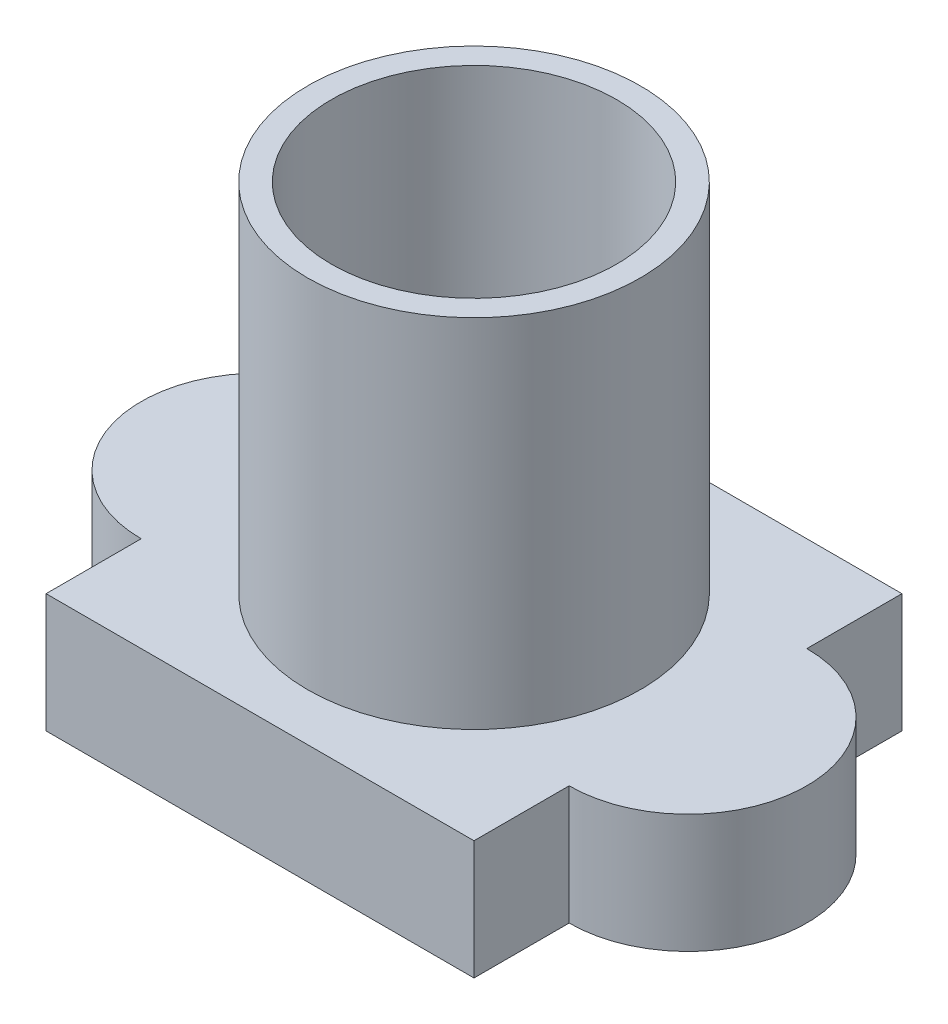
ISO-10303-21;
HEADER;
FILE_DESCRIPTION(('STEP AP214'),'2;1');
FILE_NAME('part.step','',(''),(''),'','','');
FILE_SCHEMA(('AUTOMOTIVE_DESIGN { 1 0 10303 214 1 1 1 1 }'));
ENDSEC;
DATA;
#1=APPLICATION_CONTEXT('core data for automotive mechanical design processes');
#2=APPLICATION_PROTOCOL_DEFINITION('international standard','automotive_design',2000,#1);
#3=PRODUCT_CONTEXT('',#1,'mechanical');
#4=PRODUCT('Part','Part','',(#3));
#5=PRODUCT_RELATED_PRODUCT_CATEGORY('part','',(#4));
#6=PRODUCT_DEFINITION_FORMATION('','',#4);
#7=PRODUCT_DEFINITION_CONTEXT('part definition',#1,'design');
#8=PRODUCT_DEFINITION('design','',#6,#7);
#9=PRODUCT_DEFINITION_SHAPE('','',#8);
#10=(LENGTH_UNIT() NAMED_UNIT(*) SI_UNIT(.MILLI.,.METRE.));
#11=(NAMED_UNIT(*) PLANE_ANGLE_UNIT() SI_UNIT($,.RADIAN.));
#12=(NAMED_UNIT(*) SI_UNIT($,.STERADIAN.) SOLID_ANGLE_UNIT());
#13=UNCERTAINTY_MEASURE_WITH_UNIT(LENGTH_MEASURE(1.E-05),#10,'distance_accuracy_value','');
#14=(GEOMETRIC_REPRESENTATION_CONTEXT(3) GLOBAL_UNCERTAINTY_ASSIGNED_CONTEXT((#13)) GLOBAL_UNIT_ASSIGNED_CONTEXT((#10,
#11,#12)) REPRESENTATION_CONTEXT('',''));
#15=CARTESIAN_POINT('',(0.,0.,0.));
#16=DIRECTION('',(0.,0.,1.));
#17=DIRECTION('',(1.,0.,0.));
#18=AXIS2_PLACEMENT_3D('',#15,#16,#17);
#19=CARTESIAN_POINT('',(0.,0.,0.));
#20=DIRECTION('',(0.,1.,0.));
#21=DIRECTION('',(0.,0.,1.));
#22=AXIS2_PLACEMENT_3D('',#19,#20,#21);
#23=CYLINDRICAL_SURFACE('',#22,6.);
#24=CARTESIAN_POINT('',(0.,20.,0.));
#25=DIRECTION('',(0.,1.,0.));
#26=DIRECTION('',(0.,0.,1.));
#27=AXIS2_PLACEMENT_3D('',#24,#25,#26);
#28=CIRCLE('',#27,6.);
#29=CARTESIAN_POINT('',(0.,20.,6.));
#30=VERTEX_POINT('',#29);
#31=EDGE_CURVE('E201',#30,#30,#28,.T.);
#32=ORIENTED_EDGE('',*,*,#31,.T.);
#33=EDGE_LOOP('',(#32));
#34=FACE_BOUND('',#33,.T.);
#35=CARTESIAN_POINT('',(0.,4.,0.));
#36=DIRECTION('',(0.,-1.,0.));
#37=DIRECTION('',(0.,0.,-1.));
#38=AXIS2_PLACEMENT_3D('',#35,#36,#37);
#39=CIRCLE('',#38,6.);
#40=CARTESIAN_POINT('',(0.,4.,-6.));
#41=VERTEX_POINT('',#40);
#42=EDGE_CURVE('E36',#41,#41,#39,.F.);
#43=ORIENTED_EDGE('',*,*,#42,.F.);
#44=EDGE_LOOP('',(#43));
#45=FACE_BOUND('',#44,.T.);
#46=ADVANCED_FACE('F32',(#34,#45),#23,.F.);
#47=CARTESIAN_POINT('',(0.,5.,0.));
#48=DIRECTION('',(0.,1.,0.));
#49=DIRECTION('',(0.,0.,1.));
#50=AXIS2_PLACEMENT_3D('',#47,#48,#49);
#51=PLANE('',#50);
#52=DIRECTION('',(0.,0.,1.));
#53=VECTOR('',#52,1.);
#54=CARTESIAN_POINT('',(9.,5.,0.));
#55=LINE('',#54,#53);
#56=CARTESIAN_POINT('',(9.,5.,-9.));
#57=VERTEX_POINT('',#56);
#58=CARTESIAN_POINT('',(9.,5.,-5.));
#59=VERTEX_POINT('',#58);
#60=EDGE_CURVE('E159',#57,#59,#55,.T.);
#61=ORIENTED_EDGE('',*,*,#60,.F.);
#62=DIRECTION('',(1.,0.,0.));
#63=VECTOR('',#62,1.);
#64=CARTESIAN_POINT('',(0.,5.,-9.));
#65=LINE('',#64,#63);
#66=CARTESIAN_POINT('',(-9.,5.,-9.));
#67=VERTEX_POINT('',#66);
#68=EDGE_CURVE('E188',#67,#57,#65,.T.);
#69=ORIENTED_EDGE('',*,*,#68,.F.);
#70=DIRECTION('',(0.,0.,-1.));
#71=VECTOR('',#70,1.);
#72=CARTESIAN_POINT('',(-9.00000000000004,5.,0.));
#73=LINE('',#72,#71);
#74=CARTESIAN_POINT('',(-9.,5.,-5.));
#75=VERTEX_POINT('',#74);
#76=EDGE_CURVE('E173',#75,#67,#73,.T.);
#77=ORIENTED_EDGE('',*,*,#76,.F.);
#78=CARTESIAN_POINT('',(-9.,5.,0.));
#79=DIRECTION('',(0.,1.,0.));
#80=DIRECTION('',(0.,0.,1.));
#81=AXIS2_PLACEMENT_3D('',#78,#79,#80);
#82=CIRCLE('',#81,5.);
#83=CARTESIAN_POINT('',(-9.,5.,5.));
#84=VERTEX_POINT('',#83);
#85=EDGE_CURVE('E186',#75,#84,#82,.T.);
#86=ORIENTED_EDGE('',*,*,#85,.T.);
#87=DIRECTION('',(0.,0.,-1.));
#88=VECTOR('',#87,1.);
#89=CARTESIAN_POINT('',(-8.99999999999988,5.,-1.17093834628433E-13));
#90=LINE('',#89,#88);
#91=CARTESIAN_POINT('',(-9.,5.,9.));
#92=VERTEX_POINT('',#91);
#93=EDGE_CURVE('E131',#92,#84,#90,.T.);
#94=ORIENTED_EDGE('',*,*,#93,.F.);
#95=DIRECTION('',(-1.,0.,0.));
#96=VECTOR('',#95,1.);
#97=CARTESIAN_POINT('',(0.,5.,9.));
#98=LINE('',#97,#96);
#99=CARTESIAN_POINT('',(9.,5.,9.));
#100=VERTEX_POINT('',#99);
#101=EDGE_CURVE('E116',#100,#92,#98,.T.);
#102=ORIENTED_EDGE('',*,*,#101,.F.);
#103=DIRECTION('',(0.,0.,1.));
#104=VECTOR('',#103,1.);
#105=CARTESIAN_POINT('',(9.00000000000012,5.,1.17093834628436E-13));
#106=LINE('',#105,#104);
#107=CARTESIAN_POINT('',(9.,5.,5.));
#108=VERTEX_POINT('',#107);
#109=EDGE_CURVE('E129',#108,#100,#106,.T.);
#110=ORIENTED_EDGE('',*,*,#109,.F.);
#111=CARTESIAN_POINT('',(9.,5.,0.));
#112=DIRECTION('',(0.,1.,0.));
#113=DIRECTION('',(0.,0.,1.));
#114=AXIS2_PLACEMENT_3D('',#111,#112,#113);
#115=CIRCLE('',#114,5.);
#116=EDGE_CURVE('E57',#108,#59,#115,.T.);
#117=ORIENTED_EDGE('',*,*,#116,.T.);
#118=EDGE_LOOP('',(#61,#69,#77,#86,#94,#102,#110,#117));
#119=FACE_BOUND('',#118,.T.);
#120=CARTESIAN_POINT('',(0.,5.,0.));
#121=DIRECTION('',(0.,1.,0.));
#122=DIRECTION('',(0.,0.,1.));
#123=AXIS2_PLACEMENT_3D('',#120,#121,#122);
#124=CIRCLE('',#123,7.);
#125=CARTESIAN_POINT('',(0.,5.,7.));
#126=VERTEX_POINT('',#125);
#127=EDGE_CURVE('E198',#126,#126,#124,.T.);
#128=ORIENTED_EDGE('',*,*,#127,.F.);
#129=EDGE_LOOP('',(#128));
#130=FACE_BOUND('',#129,.T.);
#131=ADVANCED_FACE('F127',(#119,#130),#51,.T.);
#132=CARTESIAN_POINT('',(9.,5.,0.));
#133=DIRECTION('',(1.,0.,0.));
#134=DIRECTION('',(0.,0.,-1.));
#135=AXIS2_PLACEMENT_3D('',#132,#133,#134);
#136=PLANE('',#135);
#137=DIRECTION('',(0.,0.,1.));
#138=VECTOR('',#137,1.);
#139=CARTESIAN_POINT('',(9.,0.,0.));
#140=LINE('',#139,#138);
#141=CARTESIAN_POINT('',(9.,0.,-9.));
#142=VERTEX_POINT('',#141);
#143=CARTESIAN_POINT('',(9.,0.,-5.));
#144=VERTEX_POINT('',#143);
#145=EDGE_CURVE('E138',#142,#144,#140,.T.);
#146=ORIENTED_EDGE('',*,*,#145,.F.);
#147=DIRECTION('',(0.,-1.,0.));
#148=VECTOR('',#147,1.);
#149=CARTESIAN_POINT('',(9.,5.,-9.));
#150=LINE('',#149,#148);
#151=EDGE_CURVE('E11',#57,#142,#150,.T.);
#152=ORIENTED_EDGE('',*,*,#151,.F.);
#153=ORIENTED_EDGE('',*,*,#60,.T.);
#154=DIRECTION('',(0.,-1.,0.));
#155=VECTOR('',#154,1.);
#156=CARTESIAN_POINT('',(9.,5.,-5.));
#157=LINE('',#156,#155);
#158=EDGE_CURVE('E90',#59,#144,#157,.T.);
#159=ORIENTED_EDGE('',*,*,#158,.T.);
#160=EDGE_LOOP('',(#146,#152,#153,#159));
#161=FACE_BOUND('',#160,.T.);
#162=ADVANCED_FACE('F34',(#161),#136,.T.);
#163=CARTESIAN_POINT('',(0.,5.,-9.));
#164=DIRECTION('',(0.,0.,-1.));
#165=DIRECTION('',(-1.,0.,0.));
#166=AXIS2_PLACEMENT_3D('',#163,#164,#165);
#167=PLANE('',#166);
#168=DIRECTION('',(1.,0.,0.));
#169=VECTOR('',#168,1.);
#170=CARTESIAN_POINT('',(0.,0.,-9.));
#171=LINE('',#170,#169);
#172=CARTESIAN_POINT('',(-9.,0.,-9.));
#173=VERTEX_POINT('',#172);
#174=EDGE_CURVE('E141',#173,#142,#171,.T.);
#175=ORIENTED_EDGE('',*,*,#174,.F.);
#176=DIRECTION('',(0.,-1.,0.));
#177=VECTOR('',#176,1.);
#178=CARTESIAN_POINT('',(-9.,5.,-9.));
#179=LINE('',#178,#177);
#180=EDGE_CURVE('E41',#67,#173,#179,.T.);
#181=ORIENTED_EDGE('',*,*,#180,.F.);
#182=ORIENTED_EDGE('',*,*,#68,.T.);
#183=ORIENTED_EDGE('',*,*,#151,.T.);
#184=EDGE_LOOP('',(#175,#181,#182,#183));
#185=FACE_BOUND('',#184,.T.);
#186=ADVANCED_FACE('F177',(#185),#167,.T.);
#187=CARTESIAN_POINT('',(-9.00000000000004,5.,0.));
#188=DIRECTION('',(-1.,0.,0.));
#189=DIRECTION('',(0.,0.,1.));
#190=AXIS2_PLACEMENT_3D('',#187,#188,#189);
#191=PLANE('',#190);
#192=DIRECTION('',(0.,0.,-1.));
#193=VECTOR('',#192,1.);
#194=CARTESIAN_POINT('',(-9.00000000000004,0.,0.));
#195=LINE('',#194,#193);
#196=CARTESIAN_POINT('',(-9.,0.,-5.));
#197=VERTEX_POINT('',#196);
#198=EDGE_CURVE('E145',#197,#173,#195,.T.);
#199=ORIENTED_EDGE('',*,*,#198,.F.);
#200=DIRECTION('',(0.,-1.,0.));
#201=VECTOR('',#200,1.);
#202=CARTESIAN_POINT('',(-9.,5.,-5.));
#203=LINE('',#202,#201);
#204=EDGE_CURVE('E165',#75,#197,#203,.T.);
#205=ORIENTED_EDGE('',*,*,#204,.F.);
#206=ORIENTED_EDGE('',*,*,#76,.T.);
#207=ORIENTED_EDGE('',*,*,#180,.T.);
#208=EDGE_LOOP('',(#199,#205,#206,#207));
#209=FACE_BOUND('',#208,.T.);
#210=ADVANCED_FACE('F171',(#209),#191,.T.);
#211=CARTESIAN_POINT('',(-9.,5.,0.));
#212=DIRECTION('',(0.,-1.,0.));
#213=DIRECTION('',(0.,0.,-1.));
#214=AXIS2_PLACEMENT_3D('',#211,#212,#213);
#215=CYLINDRICAL_SURFACE('',#214,5.);
#216=CARTESIAN_POINT('',(-9.,0.,0.));
#217=DIRECTION('',(0.,1.,0.));
#218=DIRECTION('',(0.,0.,1.));
#219=AXIS2_PLACEMENT_3D('',#216,#217,#218);
#220=CIRCLE('',#219,5.);
#221=CARTESIAN_POINT('',(-9.,0.,5.));
#222=VERTEX_POINT('',#221);
#223=EDGE_CURVE('E148',#197,#222,#220,.T.);
#224=ORIENTED_EDGE('',*,*,#223,.T.);
#225=DIRECTION('',(0.,-1.,0.));
#226=VECTOR('',#225,1.);
#227=CARTESIAN_POINT('',(-9.,5.,5.));
#228=LINE('',#227,#226);
#229=EDGE_CURVE('E163',#84,#222,#228,.T.);
#230=ORIENTED_EDGE('',*,*,#229,.F.);
#231=ORIENTED_EDGE('',*,*,#85,.F.);
#232=ORIENTED_EDGE('',*,*,#204,.T.);
#233=EDGE_LOOP('',(#224,#230,#231,#232));
#234=FACE_BOUND('',#233,.T.);
#235=ADVANCED_FACE('F184',(#234),#215,.T.);
#236=CARTESIAN_POINT('',(-8.99999999999988,5.,-1.17093834628433E-13));
#237=DIRECTION('',(-1.,0.,0.));
#238=DIRECTION('',(0.,0.,1.));
#239=AXIS2_PLACEMENT_3D('',#236,#237,#238);
#240=PLANE('',#239);
#241=DIRECTION('',(0.,0.,-1.));
#242=VECTOR('',#241,1.);
#243=CARTESIAN_POINT('',(-8.99999999999988,0.,-1.17093834628433E-13));
#244=LINE('',#243,#242);
#245=CARTESIAN_POINT('',(-9.,0.,9.));
#246=VERTEX_POINT('',#245);
#247=EDGE_CURVE('E151',#246,#222,#244,.T.);
#248=ORIENTED_EDGE('',*,*,#247,.F.);
#249=DIRECTION('',(0.,-1.,0.));
#250=VECTOR('',#249,1.);
#251=CARTESIAN_POINT('',(-9.,5.,9.));
#252=LINE('',#251,#250);
#253=EDGE_CURVE('E123',#92,#246,#252,.T.);
#254=ORIENTED_EDGE('',*,*,#253,.F.);
#255=ORIENTED_EDGE('',*,*,#93,.T.);
#256=ORIENTED_EDGE('',*,*,#229,.T.);
#257=EDGE_LOOP('',(#248,#254,#255,#256));
#258=FACE_BOUND('',#257,.T.);
#259=ADVANCED_FACE('F193',(#258),#240,.T.);
#260=CARTESIAN_POINT('',(0.,5.,9.));
#261=DIRECTION('',(0.,0.,1.));
#262=DIRECTION('',(1.,0.,0.));
#263=AXIS2_PLACEMENT_3D('',#260,#261,#262);
#264=PLANE('',#263);
#265=DIRECTION('',(-1.,0.,0.));
#266=VECTOR('',#265,1.);
#267=CARTESIAN_POINT('',(0.,0.,9.));
#268=LINE('',#267,#266);
#269=CARTESIAN_POINT('',(9.,0.,9.));
#270=VERTEX_POINT('',#269);
#271=EDGE_CURVE('E118',#270,#246,#268,.T.);
#272=ORIENTED_EDGE('',*,*,#271,.F.);
#273=DIRECTION('',(0.,-1.,0.));
#274=VECTOR('',#273,1.);
#275=CARTESIAN_POINT('',(9.,5.,9.));
#276=LINE('',#275,#274);
#277=EDGE_CURVE('E113',#100,#270,#276,.T.);
#278=ORIENTED_EDGE('',*,*,#277,.F.);
#279=ORIENTED_EDGE('',*,*,#101,.T.);
#280=ORIENTED_EDGE('',*,*,#253,.T.);
#281=EDGE_LOOP('',(#272,#278,#279,#280));
#282=FACE_BOUND('',#281,.T.);
#283=ADVANCED_FACE('F115',(#282),#264,.T.);
#284=CARTESIAN_POINT('',(9.00000000000012,5.,1.17093834628436E-13));
#285=DIRECTION('',(1.,0.,0.));
#286=DIRECTION('',(0.,0.,-1.));
#287=AXIS2_PLACEMENT_3D('',#284,#285,#286);
#288=PLANE('',#287);
#289=DIRECTION('',(0.,0.,1.));
#290=VECTOR('',#289,1.);
#291=CARTESIAN_POINT('',(9.00000000000012,0.,1.17093834628436E-13));
#292=LINE('',#291,#290);
#293=CARTESIAN_POINT('',(9.,0.,5.));
#294=VERTEX_POINT('',#293);
#295=EDGE_CURVE('E155',#294,#270,#292,.T.);
#296=ORIENTED_EDGE('',*,*,#295,.F.);
#297=DIRECTION('',(0.,-1.,0.));
#298=VECTOR('',#297,1.);
#299=CARTESIAN_POINT('',(9.,5.,5.));
#300=LINE('',#299,#298);
#301=EDGE_CURVE('E124',#108,#294,#300,.T.);
#302=ORIENTED_EDGE('',*,*,#301,.F.);
#303=ORIENTED_EDGE('',*,*,#109,.T.);
#304=ORIENTED_EDGE('',*,*,#277,.T.);
#305=EDGE_LOOP('',(#296,#302,#303,#304));
#306=FACE_BOUND('',#305,.T.);
#307=ADVANCED_FACE('F133',(#306),#288,.T.);
#308=CARTESIAN_POINT('',(9.,5.,0.));
#309=DIRECTION('',(0.,-1.,0.));
#310=DIRECTION('',(0.,0.,-1.));
#311=AXIS2_PLACEMENT_3D('',#308,#309,#310);
#312=CYLINDRICAL_SURFACE('',#311,5.);
#313=CARTESIAN_POINT('',(9.,0.,0.));
#314=DIRECTION('',(0.,1.,0.));
#315=DIRECTION('',(0.,0.,1.));
#316=AXIS2_PLACEMENT_3D('',#313,#314,#315);
#317=CIRCLE('',#316,5.);
#318=EDGE_CURVE('E157',#294,#144,#317,.T.);
#319=ORIENTED_EDGE('',*,*,#318,.T.);
#320=ORIENTED_EDGE('',*,*,#158,.F.);
#321=ORIENTED_EDGE('',*,*,#116,.F.);
#322=ORIENTED_EDGE('',*,*,#301,.T.);
#323=EDGE_LOOP('',(#319,#320,#321,#322));
#324=FACE_BOUND('',#323,.T.);
#325=ADVANCED_FACE('F196',(#324),#312,.T.);
#326=CARTESIAN_POINT('',(0.,0.,0.));
#327=DIRECTION('',(0.,1.,0.));
#328=DIRECTION('',(0.,0.,1.));
#329=AXIS2_PLACEMENT_3D('',#326,#327,#328);
#330=PLANE('',#329);
#331=DIRECTION('',(0.,0.,1.));
#332=VECTOR('',#331,1.);
#333=CARTESIAN_POINT('',(8.,0.,-8.));
#334=LINE('',#333,#332);
#335=CARTESIAN_POINT('',(8.,0.,-8.));
#336=VERTEX_POINT('',#335);
#337=CARTESIAN_POINT('',(8.,0.,-3.87298334620742));
#338=VERTEX_POINT('',#337);
#339=EDGE_CURVE('E248',#336,#338,#334,.T.);
#340=ORIENTED_EDGE('',*,*,#339,.F.);
#341=DIRECTION('',(1.,0.,0.));
#342=VECTOR('',#341,1.);
#343=CARTESIAN_POINT('',(-8.,0.,-8.));
#344=LINE('',#343,#342);
#345=CARTESIAN_POINT('',(-8.,0.,-8.));
#346=VERTEX_POINT('',#345);
#347=EDGE_CURVE('E48',#346,#336,#344,.T.);
#348=ORIENTED_EDGE('',*,*,#347,.F.);
#349=DIRECTION('',(0.,0.,-1.));
#350=VECTOR('',#349,1.);
#351=CARTESIAN_POINT('',(-8.,0.,-3.87298334620742));
#352=LINE('',#351,#350);
#353=CARTESIAN_POINT('',(-8.,0.,-3.87298334620742));
#354=VERTEX_POINT('',#353);
#355=EDGE_CURVE('E229',#354,#346,#352,.T.);
#356=ORIENTED_EDGE('',*,*,#355,.F.);
#357=CARTESIAN_POINT('',(-9.,0.,0.));
#358=DIRECTION('',(0.,-1.,0.));
#359=DIRECTION('',(0.,0.,-1.));
#360=AXIS2_PLACEMENT_3D('',#357,#358,#359);
#361=CIRCLE('',#360,4.);
#362=CARTESIAN_POINT('',(-8.,0.,3.87298334620742));
#363=VERTEX_POINT('',#362);
#364=EDGE_CURVE('E233',#363,#354,#361,.T.);
#365=ORIENTED_EDGE('',*,*,#364,.F.);
#366=DIRECTION('',(0.,0.,-1.));
#367=VECTOR('',#366,1.);
#368=CARTESIAN_POINT('',(-8.,0.,8.));
#369=LINE('',#368,#367);
#370=CARTESIAN_POINT('',(-8.,0.,8.));
#371=VERTEX_POINT('',#370);
#372=EDGE_CURVE('E236',#371,#363,#369,.T.);
#373=ORIENTED_EDGE('',*,*,#372,.F.);
#374=DIRECTION('',(-1.,0.,0.));
#375=VECTOR('',#374,1.);
#376=CARTESIAN_POINT('',(8.,0.,8.));
#377=LINE('',#376,#375);
#378=CARTESIAN_POINT('',(8.,0.,8.));
#379=VERTEX_POINT('',#378);
#380=EDGE_CURVE('E239',#379,#371,#377,.T.);
#381=ORIENTED_EDGE('',*,*,#380,.F.);
#382=DIRECTION('',(0.,0.,1.));
#383=VECTOR('',#382,1.);
#384=CARTESIAN_POINT('',(8.,0.,3.87298334620742));
#385=LINE('',#384,#383);
#386=CARTESIAN_POINT('',(8.,0.,3.87298334620742));
#387=VERTEX_POINT('',#386);
#388=EDGE_CURVE('E242',#387,#379,#385,.T.);
#389=ORIENTED_EDGE('',*,*,#388,.F.);
#390=CARTESIAN_POINT('',(9.,0.,0.));
#391=DIRECTION('',(0.,-1.,0.));
#392=DIRECTION('',(0.,0.,-1.));
#393=AXIS2_PLACEMENT_3D('',#390,#391,#392);
#394=CIRCLE('',#393,4.);
#395=EDGE_CURVE('E245',#338,#387,#394,.T.);
#396=ORIENTED_EDGE('',*,*,#395,.F.);
#397=EDGE_LOOP('',(#340,#348,#356,#365,#373,#381,#389,#396));
#398=FACE_BOUND('',#397,.T.);
#399=ORIENTED_EDGE('',*,*,#145,.T.);
#400=ORIENTED_EDGE('',*,*,#318,.F.);
#401=ORIENTED_EDGE('',*,*,#295,.T.);
#402=ORIENTED_EDGE('',*,*,#271,.T.);
#403=ORIENTED_EDGE('',*,*,#247,.T.);
#404=ORIENTED_EDGE('',*,*,#223,.F.);
#405=ORIENTED_EDGE('',*,*,#198,.T.);
#406=ORIENTED_EDGE('',*,*,#174,.T.);
#407=EDGE_LOOP('',(#399,#400,#401,#402,#403,#404,#405,#406));
#408=FACE_BOUND('',#407,.T.);
#409=ADVANCED_FACE('F180',(#398,#408),#330,.F.);
#410=CARTESIAN_POINT('',(0.,20.,0.));
#411=DIRECTION('',(0.,-1.,0.));
#412=DIRECTION('',(0.,0.,-1.));
#413=AXIS2_PLACEMENT_3D('',#410,#411,#412);
#414=CYLINDRICAL_SURFACE('',#413,7.);
#415=CARTESIAN_POINT('',(0.,20.,0.));
#416=DIRECTION('',(0.,1.,0.));
#417=DIRECTION('',(0.,0.,1.));
#418=AXIS2_PLACEMENT_3D('',#415,#416,#417);
#419=CIRCLE('',#418,7.);
#420=CARTESIAN_POINT('',(0.,20.,7.));
#421=VERTEX_POINT('',#420);
#422=EDGE_CURVE('E142',#421,#421,#419,.T.);
#423=ORIENTED_EDGE('',*,*,#422,.F.);
#424=EDGE_LOOP('',(#423));
#425=FACE_BOUND('',#424,.T.);
#426=ORIENTED_EDGE('',*,*,#127,.T.);
#427=EDGE_LOOP('',(#426));
#428=FACE_BOUND('',#427,.T.);
#429=ADVANCED_FACE('F362',(#425,#428),#414,.T.);
#430=CARTESIAN_POINT('',(0.,20.,0.));
#431=DIRECTION('',(0.,1.,0.));
#432=DIRECTION('',(0.,0.,1.));
#433=AXIS2_PLACEMENT_3D('',#430,#431,#432);
#434=PLANE('',#433);
#435=ORIENTED_EDGE('',*,*,#31,.F.);
#436=EDGE_LOOP('',(#435));
#437=FACE_BOUND('',#436,.T.);
#438=ORIENTED_EDGE('',*,*,#422,.T.);
#439=EDGE_LOOP('',(#438));
#440=FACE_BOUND('',#439,.T.);
#441=ADVANCED_FACE('F359',(#437,#440),#434,.T.);
#442=CARTESIAN_POINT('',(9.,4.,0.));
#443=DIRECTION('',(0.,-1.,0.));
#444=DIRECTION('',(0.,0.,-1.));
#445=AXIS2_PLACEMENT_3D('',#442,#443,#444);
#446=PLANE('',#445);
#447=DIRECTION('',(1.,0.,0.));
#448=VECTOR('',#447,1.);
#449=CARTESIAN_POINT('',(-8.,4.,-8.));
#450=LINE('',#449,#448);
#451=CARTESIAN_POINT('',(-8.,4.,-8.));
#452=VERTEX_POINT('',#451);
#453=CARTESIAN_POINT('',(8.,4.,-8.));
#454=VERTEX_POINT('',#453);
#455=EDGE_CURVE('E232',#452,#454,#450,.T.);
#456=ORIENTED_EDGE('',*,*,#455,.T.);
#457=DIRECTION('',(0.,0.,1.));
#458=VECTOR('',#457,1.);
#459=CARTESIAN_POINT('',(8.,4.,-8.));
#460=LINE('',#459,#458);
#461=CARTESIAN_POINT('',(8.,4.,-3.87298334620742));
#462=VERTEX_POINT('',#461);
#463=EDGE_CURVE('E269',#454,#462,#460,.T.);
#464=ORIENTED_EDGE('',*,*,#463,.T.);
#465=CARTESIAN_POINT('',(9.,4.,0.));
#466=DIRECTION('',(0.,-1.,0.));
#467=DIRECTION('',(0.,0.,-1.));
#468=AXIS2_PLACEMENT_3D('',#465,#466,#467);
#469=CIRCLE('',#468,4.);
#470=CARTESIAN_POINT('',(8.,4.,3.87298334620742));
#471=VERTEX_POINT('',#470);
#472=EDGE_CURVE('E266',#462,#471,#469,.T.);
#473=ORIENTED_EDGE('',*,*,#472,.T.);
#474=DIRECTION('',(0.,0.,1.));
#475=VECTOR('',#474,1.);
#476=CARTESIAN_POINT('',(8.,4.,3.87298334620742));
#477=LINE('',#476,#475);
#478=CARTESIAN_POINT('',(8.,4.,8.));
#479=VERTEX_POINT('',#478);
#480=EDGE_CURVE('E263',#471,#479,#477,.T.);
#481=ORIENTED_EDGE('',*,*,#480,.T.);
#482=DIRECTION('',(-1.,0.,0.));
#483=VECTOR('',#482,1.);
#484=CARTESIAN_POINT('',(8.,4.,8.));
#485=LINE('',#484,#483);
#486=CARTESIAN_POINT('',(-8.,4.,8.));
#487=VERTEX_POINT('',#486);
#488=EDGE_CURVE('E260',#479,#487,#485,.T.);
#489=ORIENTED_EDGE('',*,*,#488,.T.);
#490=DIRECTION('',(0.,0.,-1.));
#491=VECTOR('',#490,1.);
#492=CARTESIAN_POINT('',(-8.,4.,8.));
#493=LINE('',#492,#491);
#494=CARTESIAN_POINT('',(-8.,4.,3.87298334620742));
#495=VERTEX_POINT('',#494);
#496=EDGE_CURVE('E257',#487,#495,#493,.T.);
#497=ORIENTED_EDGE('',*,*,#496,.T.);
#498=CARTESIAN_POINT('',(-9.,4.,0.));
#499=DIRECTION('',(0.,-1.,0.));
#500=DIRECTION('',(0.,0.,-1.));
#501=AXIS2_PLACEMENT_3D('',#498,#499,#500);
#502=CIRCLE('',#501,4.);
#503=CARTESIAN_POINT('',(-8.,4.,-3.87298334620742));
#504=VERTEX_POINT('',#503);
#505=EDGE_CURVE('E254',#495,#504,#502,.T.);
#506=ORIENTED_EDGE('',*,*,#505,.T.);
#507=DIRECTION('',(0.,0.,-1.));
#508=VECTOR('',#507,1.);
#509=CARTESIAN_POINT('',(-8.,4.,-3.87298334620742));
#510=LINE('',#509,#508);
#511=EDGE_CURVE('E209',#504,#452,#510,.T.);
#512=ORIENTED_EDGE('',*,*,#511,.T.);
#513=EDGE_LOOP('',(#456,#464,#473,#481,#489,#497,#506,#512));
#514=FACE_BOUND('',#513,.T.);
#515=ORIENTED_EDGE('',*,*,#42,.T.);
#516=EDGE_LOOP('',(#515));
#517=FACE_BOUND('',#516,.T.);
#518=ADVANCED_FACE('F276',(#514,#517),#446,.T.);
#519=CARTESIAN_POINT('',(-8.,4.,-8.));
#520=DIRECTION('',(0.,0.,-1.));
#521=DIRECTION('',(-1.,0.,0.));
#522=AXIS2_PLACEMENT_3D('',#519,#520,#521);
#523=PLANE('',#522);
#524=ORIENTED_EDGE('',*,*,#347,.T.);
#525=DIRECTION('',(0.,-1.,0.));
#526=VECTOR('',#525,1.);
#527=CARTESIAN_POINT('',(8.,4.,-8.));
#528=LINE('',#527,#526);
#529=EDGE_CURVE('E206',#454,#336,#528,.T.);
#530=ORIENTED_EDGE('',*,*,#529,.F.);
#531=ORIENTED_EDGE('',*,*,#455,.F.);
#532=DIRECTION('',(0.,-1.,0.));
#533=VECTOR('',#532,1.);
#534=CARTESIAN_POINT('',(-8.,4.,-8.));
#535=LINE('',#534,#533);
#536=EDGE_CURVE('E227',#452,#346,#535,.T.);
#537=ORIENTED_EDGE('',*,*,#536,.T.);
#538=EDGE_LOOP('',(#524,#530,#531,#537));
#539=FACE_BOUND('',#538,.T.);
#540=ADVANCED_FACE('F282',(#539),#523,.F.);
#541=CARTESIAN_POINT('',(-8.,4.,-3.87298334620742));
#542=DIRECTION('',(-1.,0.,0.));
#543=DIRECTION('',(0.,0.,1.));
#544=AXIS2_PLACEMENT_3D('',#541,#542,#543);
#545=PLANE('',#544);
#546=ORIENTED_EDGE('',*,*,#355,.T.);
#547=ORIENTED_EDGE('',*,*,#536,.F.);
#548=ORIENTED_EDGE('',*,*,#511,.F.);
#549=DIRECTION('',(0.,-1.,0.));
#550=VECTOR('',#549,1.);
#551=CARTESIAN_POINT('',(-8.,4.,-3.87298334620742));
#552=LINE('',#551,#550);
#553=EDGE_CURVE('E224',#504,#354,#552,.T.);
#554=ORIENTED_EDGE('',*,*,#553,.T.);
#555=EDGE_LOOP('',(#546,#547,#548,#554));
#556=FACE_BOUND('',#555,.T.);
#557=ADVANCED_FACE('F302',(#556),#545,.F.);
#558=CARTESIAN_POINT('',(-9.,4.,0.));
#559=DIRECTION('',(0.,-1.,0.));
#560=DIRECTION('',(0.,0.,-1.));
#561=AXIS2_PLACEMENT_3D('',#558,#559,#560);
#562=CYLINDRICAL_SURFACE('',#561,4.);
#563=ORIENTED_EDGE('',*,*,#364,.T.);
#564=ORIENTED_EDGE('',*,*,#553,.F.);
#565=ORIENTED_EDGE('',*,*,#505,.F.);
#566=DIRECTION('',(0.,-1.,0.));
#567=VECTOR('',#566,1.);
#568=CARTESIAN_POINT('',(-8.,4.,3.87298334620742));
#569=LINE('',#568,#567);
#570=EDGE_CURVE('E221',#495,#363,#569,.T.);
#571=ORIENTED_EDGE('',*,*,#570,.T.);
#572=EDGE_LOOP('',(#563,#564,#565,#571));
#573=FACE_BOUND('',#572,.T.);
#574=ADVANCED_FACE('F307',(#573),#562,.F.);
#575=CARTESIAN_POINT('',(-8.,4.,8.));
#576=DIRECTION('',(-1.,0.,0.));
#577=DIRECTION('',(0.,0.,1.));
#578=AXIS2_PLACEMENT_3D('',#575,#576,#577);
#579=PLANE('',#578);
#580=ORIENTED_EDGE('',*,*,#372,.T.);
#581=ORIENTED_EDGE('',*,*,#570,.F.);
#582=ORIENTED_EDGE('',*,*,#496,.F.);
#583=DIRECTION('',(0.,-1.,0.));
#584=VECTOR('',#583,1.);
#585=CARTESIAN_POINT('',(-8.,4.,8.));
#586=LINE('',#585,#584);
#587=EDGE_CURVE('E218',#487,#371,#586,.T.);
#588=ORIENTED_EDGE('',*,*,#587,.T.);
#589=EDGE_LOOP('',(#580,#581,#582,#588));
#590=FACE_BOUND('',#589,.T.);
#591=ADVANCED_FACE('F333',(#590),#579,.F.);
#592=CARTESIAN_POINT('',(8.,4.,8.));
#593=DIRECTION('',(0.,0.,1.));
#594=DIRECTION('',(1.,0.,0.));
#595=AXIS2_PLACEMENT_3D('',#592,#593,#594);
#596=PLANE('',#595);
#597=ORIENTED_EDGE('',*,*,#380,.T.);
#598=ORIENTED_EDGE('',*,*,#587,.F.);
#599=ORIENTED_EDGE('',*,*,#488,.F.);
#600=DIRECTION('',(0.,-1.,0.));
#601=VECTOR('',#600,1.);
#602=CARTESIAN_POINT('',(8.,4.,8.));
#603=LINE('',#602,#601);
#604=EDGE_CURVE('E215',#479,#379,#603,.T.);
#605=ORIENTED_EDGE('',*,*,#604,.T.);
#606=EDGE_LOOP('',(#597,#598,#599,#605));
#607=FACE_BOUND('',#606,.T.);
#608=ADVANCED_FACE('F336',(#607),#596,.F.);
#609=CARTESIAN_POINT('',(8.,4.,3.87298334620742));
#610=DIRECTION('',(1.,0.,0.));
#611=DIRECTION('',(0.,0.,-1.));
#612=AXIS2_PLACEMENT_3D('',#609,#610,#611);
#613=PLANE('',#612);
#614=ORIENTED_EDGE('',*,*,#388,.T.);
#615=ORIENTED_EDGE('',*,*,#604,.F.);
#616=ORIENTED_EDGE('',*,*,#480,.F.);
#617=DIRECTION('',(0.,-1.,0.));
#618=VECTOR('',#617,1.);
#619=CARTESIAN_POINT('',(8.,4.,3.87298334620742));
#620=LINE('',#619,#618);
#621=EDGE_CURVE('E212',#471,#387,#620,.T.);
#622=ORIENTED_EDGE('',*,*,#621,.T.);
#623=EDGE_LOOP('',(#614,#615,#616,#622));
#624=FACE_BOUND('',#623,.T.);
#625=ADVANCED_FACE('F339',(#624),#613,.F.);
#626=CARTESIAN_POINT('',(9.,4.,0.));
#627=DIRECTION('',(0.,-1.,0.));
#628=DIRECTION('',(0.,0.,-1.));
#629=AXIS2_PLACEMENT_3D('',#626,#627,#628);
#630=CYLINDRICAL_SURFACE('',#629,4.);
#631=ORIENTED_EDGE('',*,*,#395,.T.);
#632=ORIENTED_EDGE('',*,*,#621,.F.);
#633=ORIENTED_EDGE('',*,*,#472,.F.);
#634=DIRECTION('',(0.,-1.,0.));
#635=VECTOR('',#634,1.);
#636=CARTESIAN_POINT('',(8.,4.,-3.87298334620742));
#637=LINE('',#636,#635);
#638=EDGE_CURVE('E208',#462,#338,#637,.T.);
#639=ORIENTED_EDGE('',*,*,#638,.T.);
#640=EDGE_LOOP('',(#631,#632,#633,#639));
#641=FACE_BOUND('',#640,.T.);
#642=ADVANCED_FACE('F322',(#641),#630,.F.);
#643=CARTESIAN_POINT('',(8.,4.,-8.));
#644=DIRECTION('',(1.,0.,0.));
#645=DIRECTION('',(0.,0.,-1.));
#646=AXIS2_PLACEMENT_3D('',#643,#644,#645);
#647=PLANE('',#646);
#648=ORIENTED_EDGE('',*,*,#339,.T.);
#649=ORIENTED_EDGE('',*,*,#638,.F.);
#650=ORIENTED_EDGE('',*,*,#463,.F.);
#651=ORIENTED_EDGE('',*,*,#529,.T.);
#652=EDGE_LOOP('',(#648,#649,#650,#651));
#653=FACE_BOUND('',#652,.T.);
#654=ADVANCED_FACE('F316',(#653),#647,.F.);
#655=CLOSED_SHELL('',(#46,#131,#162,#186,#210,#235,#259,#283,#307,#325,#409,#429,#441,#518,#540,
#557,#574,#591,#608,#625,#642,#654));
#656=MANIFOLD_SOLID_BREP('B2',#655);
#657=ADVANCED_BREP_SHAPE_REPRESENTATION('',(#18,#656),#14);
#658=SHAPE_DEFINITION_REPRESENTATION(#9,#657);
ENDSEC;
END-ISO-10303-21;
